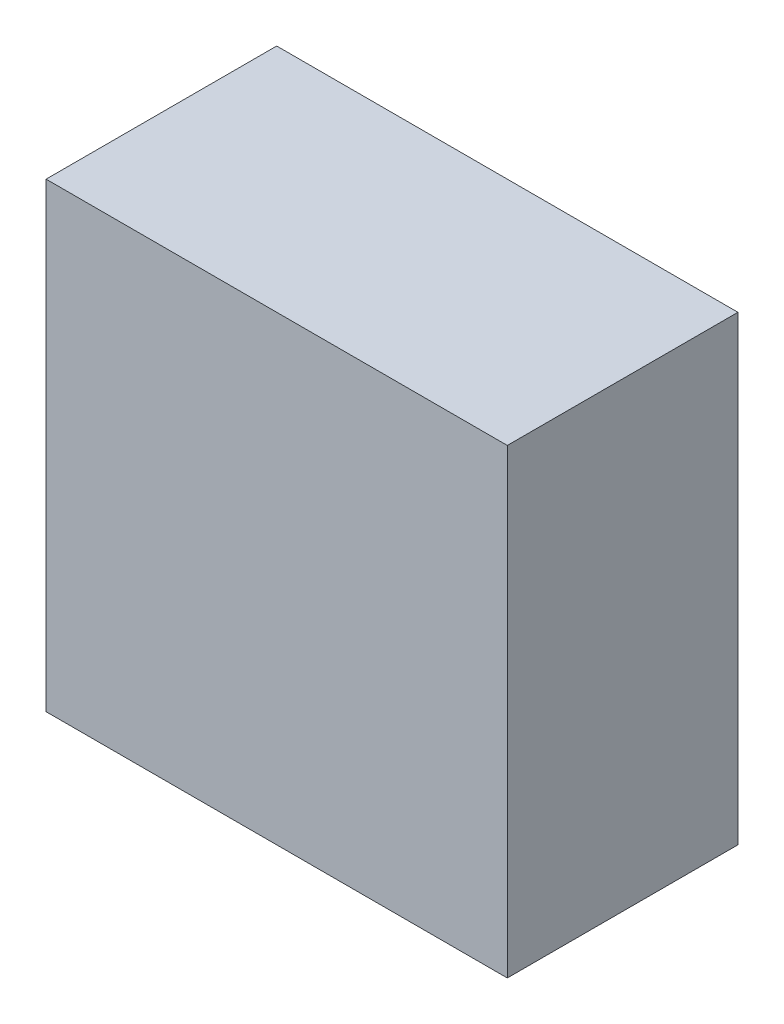
ISO-10303-21;
HEADER;
FILE_DESCRIPTION(('STEP AP214'),'2;1');
FILE_NAME('part.step','',(''),(''),'','','');
FILE_SCHEMA(('AUTOMOTIVE_DESIGN { 1 0 10303 214 1 1 1 1 }'));
ENDSEC;
DATA;
#1=APPLICATION_CONTEXT('core data for automotive mechanical design processes');
#2=APPLICATION_PROTOCOL_DEFINITION('international standard','automotive_design',2000,#1);
#3=PRODUCT_CONTEXT('',#1,'mechanical');
#4=PRODUCT('Part','Part','',(#3));
#5=PRODUCT_RELATED_PRODUCT_CATEGORY('part','',(#4));
#6=PRODUCT_DEFINITION_FORMATION('','',#4);
#7=PRODUCT_DEFINITION_CONTEXT('part definition',#1,'design');
#8=PRODUCT_DEFINITION('design','',#6,#7);
#9=PRODUCT_DEFINITION_SHAPE('','',#8);
#10=(LENGTH_UNIT() NAMED_UNIT(*) SI_UNIT(.MILLI.,.METRE.));
#11=(NAMED_UNIT(*) PLANE_ANGLE_UNIT() SI_UNIT($,.RADIAN.));
#12=(NAMED_UNIT(*) SI_UNIT($,.STERADIAN.) SOLID_ANGLE_UNIT());
#13=UNCERTAINTY_MEASURE_WITH_UNIT(LENGTH_MEASURE(1.E-05),#10,'distance_accuracy_value','');
#14=(GEOMETRIC_REPRESENTATION_CONTEXT(3) GLOBAL_UNCERTAINTY_ASSIGNED_CONTEXT((#13)) GLOBAL_UNIT_ASSIGNED_CONTEXT((#10,
#11,#12)) REPRESENTATION_CONTEXT('',''));
#15=CARTESIAN_POINT('',(0.,0.,0.));
#16=DIRECTION('',(0.,0.,1.));
#17=DIRECTION('',(1.,0.,0.));
#18=AXIS2_PLACEMENT_3D('',#15,#16,#17);
#19=CARTESIAN_POINT('',(0.,0.,12.7));
#20=DIRECTION('',(1.,0.,0.));
#21=DIRECTION('',(0.,1.,0.));
#22=AXIS2_PLACEMENT_3D('',#19,#20,#21);
#23=PLANE('',#22);
#24=DIRECTION('',(0.,-1.,0.));
#25=VECTOR('',#24,1.);
#26=CARTESIAN_POINT('',(0.,0.,0.));
#27=LINE('',#26,#25);
#28=CARTESIAN_POINT('',(0.,0.,0.));
#29=VERTEX_POINT('',#28);
#30=CARTESIAN_POINT('',(0.,-25.4,0.));
#31=VERTEX_POINT('',#30);
#32=EDGE_CURVE('E95',#29,#31,#27,.T.);
#33=ORIENTED_EDGE('',*,*,#32,.T.);
#34=DIRECTION('',(0.,0.,-1.));
#35=VECTOR('',#34,1.);
#36=CARTESIAN_POINT('',(0.,-25.4,12.7));
#37=LINE('',#36,#35);
#38=CARTESIAN_POINT('',(0.,-25.4,12.7));
#39=VERTEX_POINT('',#38);
#40=EDGE_CURVE('E11',#39,#31,#37,.T.);
#41=ORIENTED_EDGE('',*,*,#40,.F.);
#42=DIRECTION('',(0.,-1.,0.));
#43=VECTOR('',#42,1.);
#44=CARTESIAN_POINT('',(0.,0.,12.7));
#45=LINE('',#44,#43);
#46=CARTESIAN_POINT('',(0.,0.,12.7));
#47=VERTEX_POINT('',#46);
#48=EDGE_CURVE('E83',#47,#39,#45,.T.);
#49=ORIENTED_EDGE('',*,*,#48,.F.);
#50=DIRECTION('',(0.,0.,-1.));
#51=VECTOR('',#50,1.);
#52=CARTESIAN_POINT('',(0.,0.,12.7));
#53=LINE('',#52,#51);
#54=EDGE_CURVE('E91',#47,#29,#53,.T.);
#55=ORIENTED_EDGE('',*,*,#54,.T.);
#56=EDGE_LOOP('',(#33,#41,#49,#55));
#57=FACE_BOUND('',#56,.T.);
#58=ADVANCED_FACE('F32',(#57),#23,.F.);
#59=CARTESIAN_POINT('',(0.,-25.4,12.7));
#60=DIRECTION('',(0.,1.,0.));
#61=DIRECTION('',(0.,0.,1.));
#62=AXIS2_PLACEMENT_3D('',#59,#60,#61);
#63=PLANE('',#62);
#64=DIRECTION('',(1.,0.,0.));
#65=VECTOR('',#64,1.);
#66=CARTESIAN_POINT('',(0.,-25.4,0.));
#67=LINE('',#66,#65);
#68=CARTESIAN_POINT('',(25.4,-25.4,0.));
#69=VERTEX_POINT('',#68);
#70=EDGE_CURVE('E87',#31,#69,#67,.T.);
#71=ORIENTED_EDGE('',*,*,#70,.T.);
#72=DIRECTION('',(0.,0.,-1.));
#73=VECTOR('',#72,1.);
#74=CARTESIAN_POINT('',(25.4,-25.4,12.7));
#75=LINE('',#74,#73);
#76=CARTESIAN_POINT('',(25.4,-25.4,12.7));
#77=VERTEX_POINT('',#76);
#78=EDGE_CURVE('E40',#77,#69,#75,.T.);
#79=ORIENTED_EDGE('',*,*,#78,.F.);
#80=DIRECTION('',(1.,0.,0.));
#81=VECTOR('',#80,1.);
#82=CARTESIAN_POINT('',(0.,-25.4,12.7));
#83=LINE('',#82,#81);
#84=EDGE_CURVE('E78',#39,#77,#83,.T.);
#85=ORIENTED_EDGE('',*,*,#84,.F.);
#86=ORIENTED_EDGE('',*,*,#40,.T.);
#87=EDGE_LOOP('',(#71,#79,#85,#86));
#88=FACE_BOUND('',#87,.T.);
#89=ADVANCED_FACE('F86',(#88),#63,.F.);
#90=CARTESIAN_POINT('',(25.4,0.,12.7));
#91=DIRECTION('',(-1.,0.,0.));
#92=DIRECTION('',(0.,-1.,0.));
#93=AXIS2_PLACEMENT_3D('',#90,#91,#92);
#94=PLANE('',#93);
#95=DIRECTION('',(0.,1.,0.));
#96=VECTOR('',#95,1.);
#97=CARTESIAN_POINT('',(25.4,0.,0.));
#98=LINE('',#97,#96);
#99=CARTESIAN_POINT('',(25.4,0.,0.));
#100=VERTEX_POINT('',#99);
#101=EDGE_CURVE('E65',#69,#100,#98,.T.);
#102=ORIENTED_EDGE('',*,*,#101,.T.);
#103=DIRECTION('',(0.,0.,-1.));
#104=VECTOR('',#103,1.);
#105=CARTESIAN_POINT('',(25.4,0.,12.7));
#106=LINE('',#105,#104);
#107=CARTESIAN_POINT('',(25.4,0.,12.7));
#108=VERTEX_POINT('',#107);
#109=EDGE_CURVE('E88',#108,#100,#106,.T.);
#110=ORIENTED_EDGE('',*,*,#109,.F.);
#111=DIRECTION('',(0.,1.,0.));
#112=VECTOR('',#111,1.);
#113=CARTESIAN_POINT('',(25.4,0.,12.7));
#114=LINE('',#113,#112);
#115=EDGE_CURVE('E81',#77,#108,#114,.T.);
#116=ORIENTED_EDGE('',*,*,#115,.F.);
#117=ORIENTED_EDGE('',*,*,#78,.T.);
#118=EDGE_LOOP('',(#102,#110,#116,#117));
#119=FACE_BOUND('',#118,.T.);
#120=ADVANCED_FACE('F89',(#119),#94,.F.);
#121=CARTESIAN_POINT('',(0.,0.,12.7));
#122=DIRECTION('',(0.,-1.,0.));
#123=DIRECTION('',(0.,0.,-1.));
#124=AXIS2_PLACEMENT_3D('',#121,#122,#123);
#125=PLANE('',#124);
#126=DIRECTION('',(-1.,0.,0.));
#127=VECTOR('',#126,1.);
#128=CARTESIAN_POINT('',(0.,0.,0.));
#129=LINE('',#128,#127);
#130=EDGE_CURVE('E71',#100,#29,#129,.T.);
#131=ORIENTED_EDGE('',*,*,#130,.T.);
#132=ORIENTED_EDGE('',*,*,#54,.F.);
#133=DIRECTION('',(-1.,0.,0.));
#134=VECTOR('',#133,1.);
#135=CARTESIAN_POINT('',(0.,0.,12.7));
#136=LINE('',#135,#134);
#137=EDGE_CURVE('E48',#108,#47,#136,.T.);
#138=ORIENTED_EDGE('',*,*,#137,.F.);
#139=ORIENTED_EDGE('',*,*,#109,.T.);
#140=EDGE_LOOP('',(#131,#132,#138,#139));
#141=FACE_BOUND('',#140,.T.);
#142=ADVANCED_FACE('F102',(#141),#125,.F.);
#143=CARTESIAN_POINT('',(0.,0.,12.7));
#144=DIRECTION('',(0.,0.,1.));
#145=DIRECTION('',(1.,0.,0.));
#146=AXIS2_PLACEMENT_3D('',#143,#144,#145);
#147=PLANE('',#146);
#148=ORIENTED_EDGE('',*,*,#48,.T.);
#149=ORIENTED_EDGE('',*,*,#84,.T.);
#150=ORIENTED_EDGE('',*,*,#115,.T.);
#151=ORIENTED_EDGE('',*,*,#137,.T.);
#152=EDGE_LOOP('',(#148,#149,#150,#151));
#153=FACE_BOUND('',#152,.T.);
#154=ADVANCED_FACE('F79',(#153),#147,.T.);
#155=CARTESIAN_POINT('',(0.,0.,0.));
#156=DIRECTION('',(0.,0.,1.));
#157=DIRECTION('',(1.,0.,0.));
#158=AXIS2_PLACEMENT_3D('',#155,#156,#157);
#159=PLANE('',#158);
#160=ORIENTED_EDGE('',*,*,#32,.F.);
#161=ORIENTED_EDGE('',*,*,#130,.F.);
#162=ORIENTED_EDGE('',*,*,#101,.F.);
#163=ORIENTED_EDGE('',*,*,#70,.F.);
#164=EDGE_LOOP('',(#160,#161,#162,#163));
#165=FACE_BOUND('',#164,.T.);
#166=ADVANCED_FACE('F105',(#165),#159,.F.);
#167=CLOSED_SHELL('',(#58,#89,#120,#142,#154,#166));
#168=MANIFOLD_SOLID_BREP('B2',#167);
#169=ADVANCED_BREP_SHAPE_REPRESENTATION('',(#18,#168),#14);
#170=SHAPE_DEFINITION_REPRESENTATION(#9,#169);
ENDSEC;
END-ISO-10303-21;
